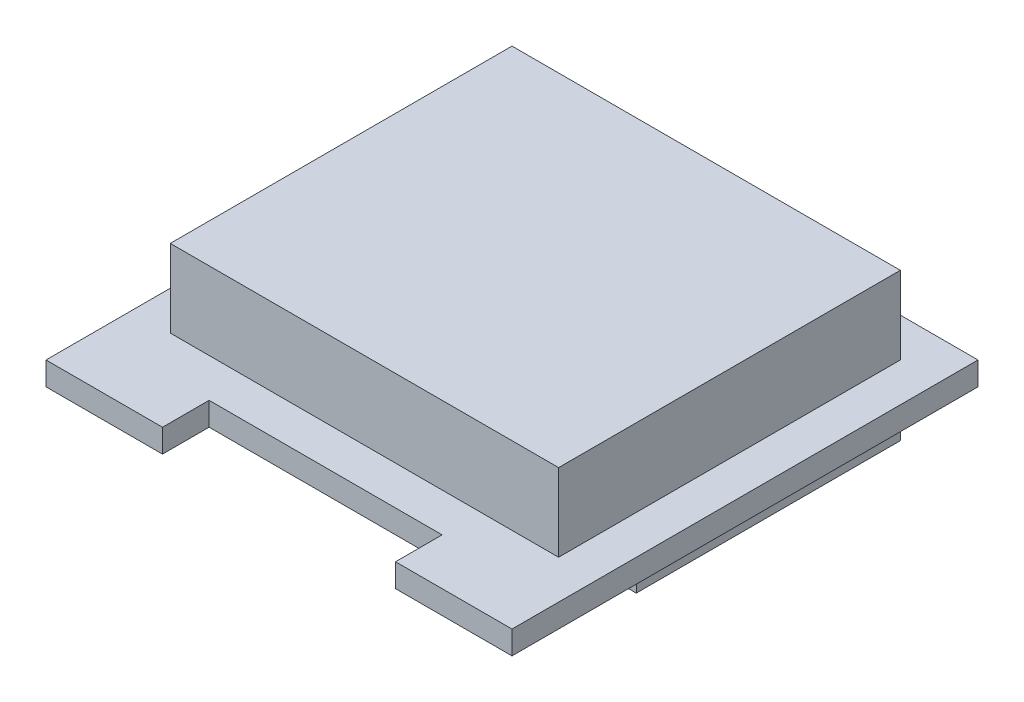
ISO-10303-21;
HEADER;
FILE_DESCRIPTION(('STEP AP214'),'2;1');
FILE_NAME('part.step','',(''),(''),'','','');
FILE_SCHEMA(('AUTOMOTIVE_DESIGN { 1 0 10303 214 1 1 1 1 }'));
ENDSEC;
DATA;
#1=APPLICATION_CONTEXT('core data for automotive mechanical design processes');
#2=APPLICATION_PROTOCOL_DEFINITION('international standard','automotive_design',2000,#1);
#3=PRODUCT_CONTEXT('',#1,'mechanical');
#4=PRODUCT('Part','Part','',(#3));
#5=PRODUCT_RELATED_PRODUCT_CATEGORY('part','',(#4));
#6=PRODUCT_DEFINITION_FORMATION('','',#4);
#7=PRODUCT_DEFINITION_CONTEXT('part definition',#1,'design');
#8=PRODUCT_DEFINITION('design','',#6,#7);
#9=PRODUCT_DEFINITION_SHAPE('','',#8);
#10=(LENGTH_UNIT() NAMED_UNIT(*) SI_UNIT(.MILLI.,.METRE.));
#11=(NAMED_UNIT(*) PLANE_ANGLE_UNIT() SI_UNIT($,.RADIAN.));
#12=(NAMED_UNIT(*) SI_UNIT($,.STERADIAN.) SOLID_ANGLE_UNIT());
#13=UNCERTAINTY_MEASURE_WITH_UNIT(LENGTH_MEASURE(1.E-05),#10,'distance_accuracy_value','');
#14=(GEOMETRIC_REPRESENTATION_CONTEXT(3) GLOBAL_UNCERTAINTY_ASSIGNED_CONTEXT((#13)) GLOBAL_UNIT_ASSIGNED_CONTEXT((#10,
#11,#12)) REPRESENTATION_CONTEXT('',''));
#15=CARTESIAN_POINT('',(0.,0.,0.));
#16=DIRECTION('',(0.,0.,1.));
#17=DIRECTION('',(1.,0.,0.));
#18=AXIS2_PLACEMENT_3D('',#15,#16,#17);
#19=CARTESIAN_POINT('',(0.,1.5,0.));
#20=DIRECTION('',(0.,1.,0.));
#21=DIRECTION('',(0.,0.,1.));
#22=AXIS2_PLACEMENT_3D('',#19,#20,#21);
#23=PLANE('',#22);
#24=DIRECTION('',(0.,0.,-1.));
#25=VECTOR('',#24,1.);
#26=CARTESIAN_POINT('',(22.5,1.5,0.));
#27=LINE('',#26,#25);
#28=CARTESIAN_POINT('',(22.5,1.5,0.));
#29=VERTEX_POINT('',#28);
#30=CARTESIAN_POINT('',(22.5,1.5,-3.));
#31=VERTEX_POINT('',#30);
#32=EDGE_CURVE('E213',#29,#31,#27,.T.);
#33=ORIENTED_EDGE('',*,*,#32,.F.);
#34=DIRECTION('',(1.,0.,0.));
#35=VECTOR('',#34,1.);
#36=CARTESIAN_POINT('',(0.,1.5,0.));
#37=LINE('',#36,#35);
#38=CARTESIAN_POINT('',(30.,1.5,0.));
#39=VERTEX_POINT('',#38);
#40=EDGE_CURVE('E216',#29,#39,#37,.T.);
#41=ORIENTED_EDGE('',*,*,#40,.T.);
#42=DIRECTION('',(0.,0.,-1.));
#43=VECTOR('',#42,1.);
#44=CARTESIAN_POINT('',(30.,1.5,0.));
#45=LINE('',#44,#43);
#46=CARTESIAN_POINT('',(30.,1.5,-30.));
#47=VERTEX_POINT('',#46);
#48=EDGE_CURVE('E219',#39,#47,#45,.T.);
#49=ORIENTED_EDGE('',*,*,#48,.T.);
#50=DIRECTION('',(1.,0.,0.));
#51=VECTOR('',#50,1.);
#52=CARTESIAN_POINT('',(0.,1.5,-30.));
#53=LINE('',#52,#51);
#54=CARTESIAN_POINT('',(0.,1.5,-30.));
#55=VERTEX_POINT('',#54);
#56=EDGE_CURVE('E222',#55,#47,#53,.T.);
#57=ORIENTED_EDGE('',*,*,#56,.F.);
#58=DIRECTION('',(0.,0.,-1.));
#59=VECTOR('',#58,1.);
#60=CARTESIAN_POINT('',(0.,1.5,0.));
#61=LINE('',#60,#59);
#62=CARTESIAN_POINT('',(0.,1.5,0.));
#63=VERTEX_POINT('',#62);
#64=EDGE_CURVE('E225',#63,#55,#61,.T.);
#65=ORIENTED_EDGE('',*,*,#64,.F.);
#66=CARTESIAN_POINT('',(7.5,1.5,0.));
#67=VERTEX_POINT('',#66);
#68=EDGE_CURVE('E220',#63,#67,#37,.T.);
#69=ORIENTED_EDGE('',*,*,#68,.T.);
#70=DIRECTION('',(0.,0.,-1.));
#71=VECTOR('',#70,1.);
#72=CARTESIAN_POINT('',(7.5,1.5,0.));
#73=LINE('',#72,#71);
#74=CARTESIAN_POINT('',(7.5,1.5,-3.));
#75=VERTEX_POINT('',#74);
#76=EDGE_CURVE('E228',#67,#75,#73,.T.);
#77=ORIENTED_EDGE('',*,*,#76,.T.);
#78=DIRECTION('',(1.,0.,0.));
#79=VECTOR('',#78,1.);
#80=CARTESIAN_POINT('',(0.,1.5,-3.));
#81=LINE('',#80,#79);
#82=EDGE_CURVE('E230',#75,#31,#81,.T.);
#83=ORIENTED_EDGE('',*,*,#82,.T.);
#84=EDGE_LOOP('',(#33,#41,#49,#57,#65,#69,#77,#83));
#85=FACE_BOUND('',#84,.T.);
#86=DIRECTION('',(1.,0.,0.));
#87=VECTOR('',#86,1.);
#88=CARTESIAN_POINT('',(0.,1.5,-5.5));
#89=LINE('',#88,#87);
#90=CARTESIAN_POINT('',(2.5,1.5,-5.5));
#91=VERTEX_POINT('',#90);
#92=CARTESIAN_POINT('',(27.5,1.5,-5.5));
#93=VERTEX_POINT('',#92);
#94=EDGE_CURVE('E197',#91,#93,#89,.T.);
#95=ORIENTED_EDGE('',*,*,#94,.F.);
#96=DIRECTION('',(0.,0.,1.));
#97=VECTOR('',#96,1.);
#98=CARTESIAN_POINT('',(2.5,1.5,0.));
#99=LINE('',#98,#97);
#100=CARTESIAN_POINT('',(2.5,1.5,-27.5));
#101=VERTEX_POINT('',#100);
#102=EDGE_CURVE('E153',#101,#91,#99,.T.);
#103=ORIENTED_EDGE('',*,*,#102,.F.);
#104=DIRECTION('',(-1.,0.,0.));
#105=VECTOR('',#104,1.);
#106=CARTESIAN_POINT('',(0.,1.5,-27.5));
#107=LINE('',#106,#105);
#108=CARTESIAN_POINT('',(27.5,1.5,-27.5));
#109=VERTEX_POINT('',#108);
#110=EDGE_CURVE('E188',#109,#101,#107,.T.);
#111=ORIENTED_EDGE('',*,*,#110,.F.);
#112=DIRECTION('',(0.,0.,-1.));
#113=VECTOR('',#112,1.);
#114=CARTESIAN_POINT('',(27.5,1.5,0.));
#115=LINE('',#114,#113);
#116=EDGE_CURVE('E199',#93,#109,#115,.T.);
#117=ORIENTED_EDGE('',*,*,#116,.F.);
#118=EDGE_LOOP('',(#95,#103,#111,#117));
#119=FACE_BOUND('',#118,.T.);
#120=ADVANCED_FACE('F35',(#85,#119),#23,.T.);
#121=CARTESIAN_POINT('',(22.5,1.5,0.));
#122=DIRECTION('',(-1.,0.,0.));
#123=DIRECTION('',(0.,0.,1.));
#124=AXIS2_PLACEMENT_3D('',#121,#122,#123);
#125=PLANE('',#124);
#126=DIRECTION('',(0.,0.,-1.));
#127=VECTOR('',#126,1.);
#128=CARTESIAN_POINT('',(22.5,0.,0.));
#129=LINE('',#128,#127);
#130=CARTESIAN_POINT('',(22.5,0.,0.));
#131=VERTEX_POINT('',#130);
#132=CARTESIAN_POINT('',(22.5,0.,-3.));
#133=VERTEX_POINT('',#132);
#134=EDGE_CURVE('E212',#131,#133,#129,.T.);
#135=ORIENTED_EDGE('',*,*,#134,.F.);
#136=DIRECTION('',(0.,-1.,0.));
#137=VECTOR('',#136,1.);
#138=CARTESIAN_POINT('',(22.5,1.5,0.));
#139=LINE('',#138,#137);
#140=EDGE_CURVE('E11',#29,#131,#139,.T.);
#141=ORIENTED_EDGE('',*,*,#140,.F.);
#142=ORIENTED_EDGE('',*,*,#32,.T.);
#143=DIRECTION('',(0.,-1.,0.));
#144=VECTOR('',#143,1.);
#145=CARTESIAN_POINT('',(22.5,1.5,-3.));
#146=LINE('',#145,#144);
#147=EDGE_CURVE('E232',#31,#133,#146,.T.);
#148=ORIENTED_EDGE('',*,*,#147,.T.);
#149=EDGE_LOOP('',(#135,#141,#142,#148));
#150=FACE_BOUND('',#149,.T.);
#151=ADVANCED_FACE('F37',(#150),#125,.T.);
#152=CARTESIAN_POINT('',(0.,1.5,0.));
#153=DIRECTION('',(0.,0.,-1.));
#154=DIRECTION('',(-1.,0.,0.));
#155=AXIS2_PLACEMENT_3D('',#152,#153,#154);
#156=PLANE('',#155);
#157=DIRECTION('',(1.,0.,0.));
#158=VECTOR('',#157,1.);
#159=CARTESIAN_POINT('',(0.,0.,0.));
#160=LINE('',#159,#158);
#161=CARTESIAN_POINT('',(30.,0.,0.));
#162=VERTEX_POINT('',#161);
#163=EDGE_CURVE('E235',#131,#162,#160,.T.);
#164=ORIENTED_EDGE('',*,*,#163,.T.);
#165=DIRECTION('',(0.,-1.,0.));
#166=VECTOR('',#165,1.);
#167=CARTESIAN_POINT('',(30.,1.5,0.));
#168=LINE('',#167,#166);
#169=EDGE_CURVE('E43',#39,#162,#168,.T.);
#170=ORIENTED_EDGE('',*,*,#169,.F.);
#171=ORIENTED_EDGE('',*,*,#40,.F.);
#172=ORIENTED_EDGE('',*,*,#140,.T.);
#173=EDGE_LOOP('',(#164,#170,#171,#172));
#174=FACE_BOUND('',#173,.T.);
#175=ADVANCED_FACE('F303',(#174),#156,.F.);
#176=CARTESIAN_POINT('',(30.,1.5,0.));
#177=DIRECTION('',(-1.,0.,0.));
#178=DIRECTION('',(0.,0.,1.));
#179=AXIS2_PLACEMENT_3D('',#176,#177,#178);
#180=PLANE('',#179);
#181=DIRECTION('',(0.,0.,-1.));
#182=VECTOR('',#181,1.);
#183=CARTESIAN_POINT('',(30.,0.,0.));
#184=LINE('',#183,#182);
#185=CARTESIAN_POINT('',(30.,0.,-30.));
#186=VERTEX_POINT('',#185);
#187=EDGE_CURVE('E237',#162,#186,#184,.T.);
#188=ORIENTED_EDGE('',*,*,#187,.T.);
#189=DIRECTION('',(0.,-1.,0.));
#190=VECTOR('',#189,1.);
#191=CARTESIAN_POINT('',(30.,1.5,-30.));
#192=LINE('',#191,#190);
#193=EDGE_CURVE('E262',#47,#186,#192,.T.);
#194=ORIENTED_EDGE('',*,*,#193,.F.);
#195=ORIENTED_EDGE('',*,*,#48,.F.);
#196=ORIENTED_EDGE('',*,*,#169,.T.);
#197=EDGE_LOOP('',(#188,#194,#195,#196));
#198=FACE_BOUND('',#197,.T.);
#199=ADVANCED_FACE('F268',(#198),#180,.F.);
#200=CARTESIAN_POINT('',(0.,1.5,-30.));
#201=DIRECTION('',(0.,0.,-1.));
#202=DIRECTION('',(-1.,0.,0.));
#203=AXIS2_PLACEMENT_3D('',#200,#201,#202);
#204=PLANE('',#203);
#205=DIRECTION('',(1.,0.,0.));
#206=VECTOR('',#205,1.);
#207=CARTESIAN_POINT('',(0.,0.,-30.));
#208=LINE('',#207,#206);
#209=CARTESIAN_POINT('',(0.,0.,-30.));
#210=VERTEX_POINT('',#209);
#211=EDGE_CURVE('E241',#210,#186,#208,.T.);
#212=ORIENTED_EDGE('',*,*,#211,.F.);
#213=DIRECTION('',(0.,-1.,0.));
#214=VECTOR('',#213,1.);
#215=CARTESIAN_POINT('',(0.,1.5,-30.));
#216=LINE('',#215,#214);
#217=EDGE_CURVE('E260',#55,#210,#216,.T.);
#218=ORIENTED_EDGE('',*,*,#217,.F.);
#219=ORIENTED_EDGE('',*,*,#56,.T.);
#220=ORIENTED_EDGE('',*,*,#193,.T.);
#221=EDGE_LOOP('',(#212,#218,#219,#220));
#222=FACE_BOUND('',#221,.T.);
#223=ADVANCED_FACE('F280',(#222),#204,.T.);
#224=CARTESIAN_POINT('',(0.,1.5,0.));
#225=DIRECTION('',(-1.,0.,0.));
#226=DIRECTION('',(0.,0.,1.));
#227=AXIS2_PLACEMENT_3D('',#224,#225,#226);
#228=PLANE('',#227);
#229=DIRECTION('',(0.,0.,-1.));
#230=VECTOR('',#229,1.);
#231=CARTESIAN_POINT('',(0.,0.,0.));
#232=LINE('',#231,#230);
#233=CARTESIAN_POINT('',(0.,0.,0.));
#234=VERTEX_POINT('',#233);
#235=EDGE_CURVE('E244',#234,#210,#232,.T.);
#236=ORIENTED_EDGE('',*,*,#235,.F.);
#237=DIRECTION('',(0.,-1.,0.));
#238=VECTOR('',#237,1.);
#239=CARTESIAN_POINT('',(0.,1.5,0.));
#240=LINE('',#239,#238);
#241=EDGE_CURVE('E258',#63,#234,#240,.T.);
#242=ORIENTED_EDGE('',*,*,#241,.F.);
#243=ORIENTED_EDGE('',*,*,#64,.T.);
#244=ORIENTED_EDGE('',*,*,#217,.T.);
#245=EDGE_LOOP('',(#236,#242,#243,#244));
#246=FACE_BOUND('',#245,.T.);
#247=ADVANCED_FACE('F287',(#246),#228,.T.);
#248=CARTESIAN_POINT('',(7.5,0.,0.));
#249=VERTEX_POINT('',#248);
#250=EDGE_CURVE('E238',#234,#249,#160,.T.);
#251=ORIENTED_EDGE('',*,*,#250,.T.);
#252=DIRECTION('',(0.,-1.,0.));
#253=VECTOR('',#252,1.);
#254=CARTESIAN_POINT('',(7.5,1.5,0.));
#255=LINE('',#254,#253);
#256=EDGE_CURVE('E255',#67,#249,#255,.T.);
#257=ORIENTED_EDGE('',*,*,#256,.F.);
#258=ORIENTED_EDGE('',*,*,#68,.F.);
#259=ORIENTED_EDGE('',*,*,#241,.T.);
#260=EDGE_LOOP('',(#251,#257,#258,#259));
#261=FACE_BOUND('',#260,.T.);
#262=ADVANCED_FACE('F291',(#261),#156,.F.);
#263=CARTESIAN_POINT('',(7.5,1.5,0.));
#264=DIRECTION('',(-1.,0.,0.));
#265=DIRECTION('',(0.,0.,1.));
#266=AXIS2_PLACEMENT_3D('',#263,#264,#265);
#267=PLANE('',#266);
#268=DIRECTION('',(0.,0.,-1.));
#269=VECTOR('',#268,1.);
#270=CARTESIAN_POINT('',(7.5,0.,0.));
#271=LINE('',#270,#269);
#272=CARTESIAN_POINT('',(7.5,0.,-3.));
#273=VERTEX_POINT('',#272);
#274=EDGE_CURVE('E247',#249,#273,#271,.T.);
#275=ORIENTED_EDGE('',*,*,#274,.T.);
#276=DIRECTION('',(0.,-1.,0.));
#277=VECTOR('',#276,1.);
#278=CARTESIAN_POINT('',(7.5,1.5,-3.));
#279=LINE('',#278,#277);
#280=EDGE_CURVE('E252',#75,#273,#279,.T.);
#281=ORIENTED_EDGE('',*,*,#280,.F.);
#282=ORIENTED_EDGE('',*,*,#76,.F.);
#283=ORIENTED_EDGE('',*,*,#256,.T.);
#284=EDGE_LOOP('',(#275,#281,#282,#283));
#285=FACE_BOUND('',#284,.T.);
#286=ADVANCED_FACE('F297',(#285),#267,.F.);
#287=CARTESIAN_POINT('',(0.,1.5,-3.));
#288=DIRECTION('',(0.,0.,-1.));
#289=DIRECTION('',(-1.,0.,0.));
#290=AXIS2_PLACEMENT_3D('',#287,#288,#289);
#291=PLANE('',#290);
#292=DIRECTION('',(1.,0.,0.));
#293=VECTOR('',#292,1.);
#294=CARTESIAN_POINT('',(0.,0.,-3.));
#295=LINE('',#294,#293);
#296=EDGE_CURVE('E217',#273,#133,#295,.T.);
#297=ORIENTED_EDGE('',*,*,#296,.T.);
#298=ORIENTED_EDGE('',*,*,#147,.F.);
#299=ORIENTED_EDGE('',*,*,#82,.F.);
#300=ORIENTED_EDGE('',*,*,#280,.T.);
#301=EDGE_LOOP('',(#297,#298,#299,#300));
#302=FACE_BOUND('',#301,.T.);
#303=ADVANCED_FACE('F301',(#302),#291,.F.);
#304=CARTESIAN_POINT('',(0.,0.,0.));
#305=DIRECTION('',(0.,1.,0.));
#306=DIRECTION('',(0.,0.,1.));
#307=AXIS2_PLACEMENT_3D('',#304,#305,#306);
#308=PLANE('',#307);
#309=DIRECTION('',(0.,0.,-1.));
#310=VECTOR('',#309,1.);
#311=CARTESIAN_POINT('',(2.5,0.,0.));
#312=LINE('',#311,#310);
#313=CARTESIAN_POINT('',(2.5,0.,-10.5));
#314=VERTEX_POINT('',#313);
#315=CARTESIAN_POINT('',(2.5,0.,-27.5));
#316=VERTEX_POINT('',#315);
#317=EDGE_CURVE('E50',#314,#316,#312,.T.);
#318=ORIENTED_EDGE('',*,*,#317,.F.);
#319=DIRECTION('',(1.,0.,0.));
#320=VECTOR('',#319,1.);
#321=CARTESIAN_POINT('',(0.,0.,-10.5));
#322=LINE('',#321,#320);
#323=CARTESIAN_POINT('',(27.5,0.,-10.5));
#324=VERTEX_POINT('',#323);
#325=EDGE_CURVE('E151',#314,#324,#322,.T.);
#326=ORIENTED_EDGE('',*,*,#325,.T.);
#327=DIRECTION('',(0.,0.,1.));
#328=VECTOR('',#327,1.);
#329=CARTESIAN_POINT('',(27.5,0.,0.));
#330=LINE('',#329,#328);
#331=CARTESIAN_POINT('',(27.5,0.,-27.5));
#332=VERTEX_POINT('',#331);
#333=EDGE_CURVE('E168',#332,#324,#330,.T.);
#334=ORIENTED_EDGE('',*,*,#333,.F.);
#335=DIRECTION('',(1.,0.,0.));
#336=VECTOR('',#335,1.);
#337=CARTESIAN_POINT('',(0.,0.,-27.5));
#338=LINE('',#337,#336);
#339=EDGE_CURVE('E55',#316,#332,#338,.T.);
#340=ORIENTED_EDGE('',*,*,#339,.F.);
#341=EDGE_LOOP('',(#318,#326,#334,#340));
#342=FACE_BOUND('',#341,.T.);
#343=ORIENTED_EDGE('',*,*,#134,.T.);
#344=ORIENTED_EDGE('',*,*,#296,.F.);
#345=ORIENTED_EDGE('',*,*,#274,.F.);
#346=ORIENTED_EDGE('',*,*,#250,.F.);
#347=ORIENTED_EDGE('',*,*,#235,.T.);
#348=ORIENTED_EDGE('',*,*,#211,.T.);
#349=ORIENTED_EDGE('',*,*,#187,.F.);
#350=ORIENTED_EDGE('',*,*,#163,.F.);
#351=EDGE_LOOP('',(#343,#344,#345,#346,#347,#348,#349,#350));
#352=FACE_BOUND('',#351,.T.);
#353=ADVANCED_FACE('F274',(#342,#352),#308,.F.);
#354=CARTESIAN_POINT('',(2.5,6.5,0.));
#355=DIRECTION('',(1.,0.,0.));
#356=DIRECTION('',(0.,0.,-1.));
#357=AXIS2_PLACEMENT_3D('',#354,#355,#356);
#358=PLANE('',#357);
#359=ORIENTED_EDGE('',*,*,#102,.T.);
#360=DIRECTION('',(0.,-1.,0.));
#361=VECTOR('',#360,1.);
#362=CARTESIAN_POINT('',(2.5,6.5,-5.5));
#363=LINE('',#362,#361);
#364=CARTESIAN_POINT('',(2.5,6.5,-5.5));
#365=VERTEX_POINT('',#364);
#366=EDGE_CURVE('E210',#365,#91,#363,.T.);
#367=ORIENTED_EDGE('',*,*,#366,.F.);
#368=DIRECTION('',(0.,0.,1.));
#369=VECTOR('',#368,1.);
#370=CARTESIAN_POINT('',(2.5,6.5,0.));
#371=LINE('',#370,#369);
#372=CARTESIAN_POINT('',(2.5,6.5,-27.5));
#373=VERTEX_POINT('',#372);
#374=EDGE_CURVE('E184',#373,#365,#371,.T.);
#375=ORIENTED_EDGE('',*,*,#374,.F.);
#376=DIRECTION('',(0.,-1.,0.));
#377=VECTOR('',#376,1.);
#378=CARTESIAN_POINT('',(2.5,6.5,-27.5));
#379=LINE('',#378,#377);
#380=EDGE_CURVE('E194',#373,#101,#379,.T.);
#381=ORIENTED_EDGE('',*,*,#380,.T.);
#382=EDGE_LOOP('',(#359,#367,#375,#381));
#383=FACE_BOUND('',#382,.T.);
#384=ADVANCED_FACE('F319',(#383),#358,.F.);
#385=CARTESIAN_POINT('',(0.,6.5,-5.5));
#386=DIRECTION('',(0.,0.,-1.));
#387=DIRECTION('',(-1.,0.,0.));
#388=AXIS2_PLACEMENT_3D('',#385,#386,#387);
#389=PLANE('',#388);
#390=ORIENTED_EDGE('',*,*,#94,.T.);
#391=DIRECTION('',(0.,-1.,0.));
#392=VECTOR('',#391,1.);
#393=CARTESIAN_POINT('',(27.5,6.5,-5.5));
#394=LINE('',#393,#392);
#395=CARTESIAN_POINT('',(27.5,6.5,-5.5));
#396=VERTEX_POINT('',#395);
#397=EDGE_CURVE('E207',#396,#93,#394,.T.);
#398=ORIENTED_EDGE('',*,*,#397,.F.);
#399=DIRECTION('',(1.,0.,0.));
#400=VECTOR('',#399,1.);
#401=CARTESIAN_POINT('',(0.,6.5,-5.5));
#402=LINE('',#401,#400);
#403=EDGE_CURVE('E187',#365,#396,#402,.T.);
#404=ORIENTED_EDGE('',*,*,#403,.F.);
#405=ORIENTED_EDGE('',*,*,#366,.T.);
#406=EDGE_LOOP('',(#390,#398,#404,#405));
#407=FACE_BOUND('',#406,.T.);
#408=ADVANCED_FACE('F346',(#407),#389,.F.);
#409=CARTESIAN_POINT('',(27.5,6.5,0.));
#410=DIRECTION('',(-1.,0.,0.));
#411=DIRECTION('',(0.,0.,1.));
#412=AXIS2_PLACEMENT_3D('',#409,#410,#411);
#413=PLANE('',#412);
#414=ORIENTED_EDGE('',*,*,#116,.T.);
#415=DIRECTION('',(0.,-1.,0.));
#416=VECTOR('',#415,1.);
#417=CARTESIAN_POINT('',(27.5,6.5,-27.5));
#418=LINE('',#417,#416);
#419=CARTESIAN_POINT('',(27.5,6.5,-27.5));
#420=VERTEX_POINT('',#419);
#421=EDGE_CURVE('E205',#420,#109,#418,.T.);
#422=ORIENTED_EDGE('',*,*,#421,.F.);
#423=DIRECTION('',(0.,0.,-1.));
#424=VECTOR('',#423,1.);
#425=CARTESIAN_POINT('',(27.5,6.5,0.));
#426=LINE('',#425,#424);
#427=EDGE_CURVE('E190',#396,#420,#426,.T.);
#428=ORIENTED_EDGE('',*,*,#427,.F.);
#429=ORIENTED_EDGE('',*,*,#397,.T.);
#430=EDGE_LOOP('',(#414,#422,#428,#429));
#431=FACE_BOUND('',#430,.T.);
#432=ADVANCED_FACE('F353',(#431),#413,.F.);
#433=CARTESIAN_POINT('',(0.,6.5,-27.5));
#434=DIRECTION('',(0.,0.,1.));
#435=DIRECTION('',(1.,0.,0.));
#436=AXIS2_PLACEMENT_3D('',#433,#434,#435);
#437=PLANE('',#436);
#438=ORIENTED_EDGE('',*,*,#110,.T.);
#439=ORIENTED_EDGE('',*,*,#380,.F.);
#440=DIRECTION('',(-1.,0.,0.));
#441=VECTOR('',#440,1.);
#442=CARTESIAN_POINT('',(0.,6.5,-27.5));
#443=LINE('',#442,#441);
#444=EDGE_CURVE('E192',#420,#373,#443,.T.);
#445=ORIENTED_EDGE('',*,*,#444,.F.);
#446=ORIENTED_EDGE('',*,*,#421,.T.);
#447=EDGE_LOOP('',(#438,#439,#445,#446));
#448=FACE_BOUND('',#447,.T.);
#449=ADVANCED_FACE('F360',(#448),#437,.F.);
#450=CARTESIAN_POINT('',(0.,6.5,0.));
#451=DIRECTION('',(0.,1.,0.));
#452=DIRECTION('',(0.,0.,1.));
#453=AXIS2_PLACEMENT_3D('',#450,#451,#452);
#454=PLANE('',#453);
#455=ORIENTED_EDGE('',*,*,#374,.T.);
#456=ORIENTED_EDGE('',*,*,#403,.T.);
#457=ORIENTED_EDGE('',*,*,#427,.T.);
#458=ORIENTED_EDGE('',*,*,#444,.T.);
#459=EDGE_LOOP('',(#455,#456,#457,#458));
#460=FACE_BOUND('',#459,.T.);
#461=ADVANCED_FACE('F368',(#460),#454,.T.);
#462=CARTESIAN_POINT('',(0.,-3.,-10.5));
#463=DIRECTION('',(0.,0.,1.));
#464=DIRECTION('',(1.,0.,0.));
#465=AXIS2_PLACEMENT_3D('',#462,#463,#464);
#466=PLANE('',#465);
#467=ORIENTED_EDGE('',*,*,#325,.F.);
#468=DIRECTION('',(0.,1.,0.));
#469=VECTOR('',#468,1.);
#470=CARTESIAN_POINT('',(2.5,-3.,-10.5));
#471=LINE('',#470,#469);
#472=CARTESIAN_POINT('',(2.5,-3.,-10.5));
#473=VERTEX_POINT('',#472);
#474=EDGE_CURVE('E145',#473,#314,#471,.T.);
#475=ORIENTED_EDGE('',*,*,#474,.F.);
#476=DIRECTION('',(1.,0.,0.));
#477=VECTOR('',#476,1.);
#478=CARTESIAN_POINT('',(0.,-3.,-10.5));
#479=LINE('',#478,#477);
#480=CARTESIAN_POINT('',(27.5,-3.,-10.5));
#481=VERTEX_POINT('',#480);
#482=EDGE_CURVE('E150',#473,#481,#479,.T.);
#483=ORIENTED_EDGE('',*,*,#482,.T.);
#484=DIRECTION('',(0.,1.,0.));
#485=VECTOR('',#484,1.);
#486=CARTESIAN_POINT('',(27.5,-3.,-10.5));
#487=LINE('',#486,#485);
#488=EDGE_CURVE('E175',#481,#324,#487,.T.);
#489=ORIENTED_EDGE('',*,*,#488,.T.);
#490=EDGE_LOOP('',(#467,#475,#483,#489));
#491=FACE_BOUND('',#490,.T.);
#492=ADVANCED_FACE('F147',(#491),#466,.T.);
#493=CARTESIAN_POINT('',(2.5,-3.,0.));
#494=DIRECTION('',(1.,0.,0.));
#495=DIRECTION('',(0.,0.,-1.));
#496=AXIS2_PLACEMENT_3D('',#493,#494,#495);
#497=PLANE('',#496);
#498=ORIENTED_EDGE('',*,*,#317,.T.);
#499=DIRECTION('',(0.,1.,0.));
#500=VECTOR('',#499,1.);
#501=CARTESIAN_POINT('',(2.5,-3.,-27.5));
#502=LINE('',#501,#500);
#503=CARTESIAN_POINT('',(2.5,-3.,-27.5));
#504=VERTEX_POINT('',#503);
#505=EDGE_CURVE('E154',#504,#316,#502,.T.);
#506=ORIENTED_EDGE('',*,*,#505,.F.);
#507=DIRECTION('',(0.,0.,-1.));
#508=VECTOR('',#507,1.);
#509=CARTESIAN_POINT('',(2.5,-3.,0.));
#510=LINE('',#509,#508);
#511=EDGE_CURVE('E157',#473,#504,#510,.T.);
#512=ORIENTED_EDGE('',*,*,#511,.F.);
#513=ORIENTED_EDGE('',*,*,#474,.T.);
#514=EDGE_LOOP('',(#498,#506,#512,#513));
#515=FACE_BOUND('',#514,.T.);
#516=ADVANCED_FACE('F158',(#515),#497,.F.);
#517=CARTESIAN_POINT('',(0.,-3.,-27.5));
#518=DIRECTION('',(0.,0.,1.));
#519=DIRECTION('',(1.,0.,0.));
#520=AXIS2_PLACEMENT_3D('',#517,#518,#519);
#521=PLANE('',#520);
#522=ORIENTED_EDGE('',*,*,#339,.T.);
#523=DIRECTION('',(0.,1.,0.));
#524=VECTOR('',#523,1.);
#525=CARTESIAN_POINT('',(27.5,-3.,-27.5));
#526=LINE('',#525,#524);
#527=CARTESIAN_POINT('',(27.5,-3.,-27.5));
#528=VERTEX_POINT('',#527);
#529=EDGE_CURVE('E180',#528,#332,#526,.T.);
#530=ORIENTED_EDGE('',*,*,#529,.F.);
#531=DIRECTION('',(1.,0.,0.));
#532=VECTOR('',#531,1.);
#533=CARTESIAN_POINT('',(0.,-3.,-27.5));
#534=LINE('',#533,#532);
#535=EDGE_CURVE('E162',#504,#528,#534,.T.);
#536=ORIENTED_EDGE('',*,*,#535,.F.);
#537=ORIENTED_EDGE('',*,*,#505,.T.);
#538=EDGE_LOOP('',(#522,#530,#536,#537));
#539=FACE_BOUND('',#538,.T.);
#540=ADVANCED_FACE('F387',(#539),#521,.F.);
#541=CARTESIAN_POINT('',(27.5,-3.,0.));
#542=DIRECTION('',(-1.,0.,0.));
#543=DIRECTION('',(0.,0.,1.));
#544=AXIS2_PLACEMENT_3D('',#541,#542,#543);
#545=PLANE('',#544);
#546=ORIENTED_EDGE('',*,*,#333,.T.);
#547=ORIENTED_EDGE('',*,*,#488,.F.);
#548=DIRECTION('',(0.,0.,1.));
#549=VECTOR('',#548,1.);
#550=CARTESIAN_POINT('',(27.5,-3.,0.));
#551=LINE('',#550,#549);
#552=EDGE_CURVE('E166',#528,#481,#551,.T.);
#553=ORIENTED_EDGE('',*,*,#552,.F.);
#554=ORIENTED_EDGE('',*,*,#529,.T.);
#555=EDGE_LOOP('',(#546,#547,#553,#554));
#556=FACE_BOUND('',#555,.T.);
#557=ADVANCED_FACE('F394',(#556),#545,.F.);
#558=CARTESIAN_POINT('',(0.,-3.,0.));
#559=DIRECTION('',(0.,-1.,0.));
#560=DIRECTION('',(0.,0.,-1.));
#561=AXIS2_PLACEMENT_3D('',#558,#559,#560);
#562=PLANE('',#561);
#563=ORIENTED_EDGE('',*,*,#482,.F.);
#564=ORIENTED_EDGE('',*,*,#511,.T.);
#565=ORIENTED_EDGE('',*,*,#535,.T.);
#566=ORIENTED_EDGE('',*,*,#552,.T.);
#567=EDGE_LOOP('',(#563,#564,#565,#566));
#568=FACE_BOUND('',#567,.T.);
#569=ADVANCED_FACE('F164',(#568),#562,.T.);
#570=CLOSED_SHELL('',(#120,#151,#175,#199,#223,#247,#262,#286,#303,#353,#384,#408,#432,#449,
#461,#492,#516,#540,#557,#569));
#571=MANIFOLD_SOLID_BREP('B2',#570);
#572=ADVANCED_BREP_SHAPE_REPRESENTATION('',(#18,#571),#14);
#573=SHAPE_DEFINITION_REPRESENTATION(#9,#572);
ENDSEC;
END-ISO-10303-21;
